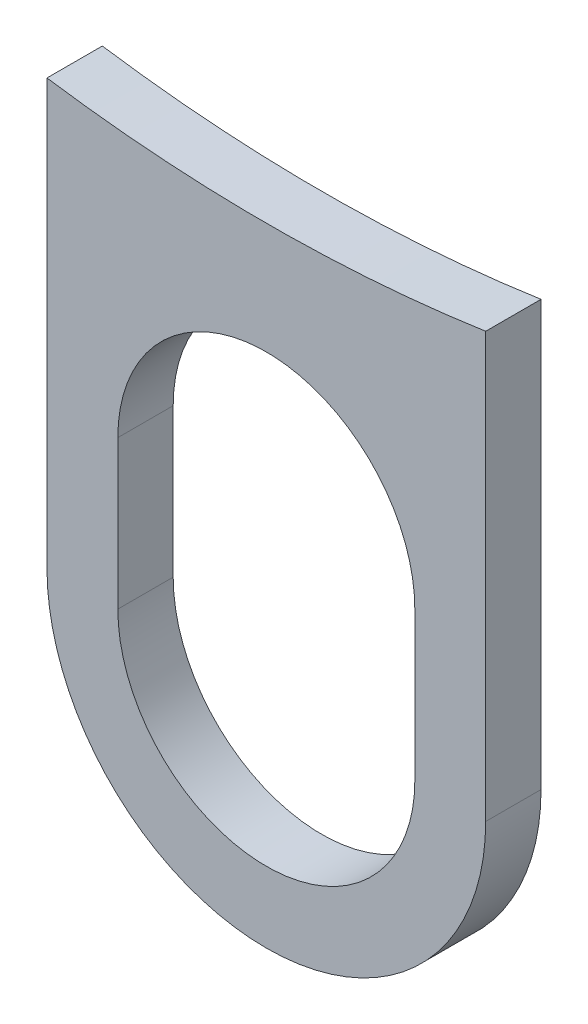
ISO-10303-21;
HEADER;
FILE_DESCRIPTION(('STEP AP214'),'2;1');
FILE_NAME('part.step','',(''),(''),'','','');
FILE_SCHEMA(('AUTOMOTIVE_DESIGN { 1 0 10303 214 1 1 1 1 }'));
ENDSEC;
DATA;
#1=APPLICATION_CONTEXT('core data for automotive mechanical design processes');
#2=APPLICATION_PROTOCOL_DEFINITION('international standard','automotive_design',2000,#1);
#3=PRODUCT_CONTEXT('',#1,'mechanical');
#4=PRODUCT('Part','Part','',(#3));
#5=PRODUCT_RELATED_PRODUCT_CATEGORY('part','',(#4));
#6=PRODUCT_DEFINITION_FORMATION('','',#4);
#7=PRODUCT_DEFINITION_CONTEXT('part definition',#1,'design');
#8=PRODUCT_DEFINITION('design','',#6,#7);
#9=PRODUCT_DEFINITION_SHAPE('','',#8);
#10=(LENGTH_UNIT() NAMED_UNIT(*) SI_UNIT(.MILLI.,.METRE.));
#11=(NAMED_UNIT(*) PLANE_ANGLE_UNIT() SI_UNIT($,.RADIAN.));
#12=(NAMED_UNIT(*) SI_UNIT($,.STERADIAN.) SOLID_ANGLE_UNIT());
#13=UNCERTAINTY_MEASURE_WITH_UNIT(LENGTH_MEASURE(1.E-05),#10,'distance_accuracy_value','');
#14=(GEOMETRIC_REPRESENTATION_CONTEXT(3) GLOBAL_UNCERTAINTY_ASSIGNED_CONTEXT((#13)) GLOBAL_UNIT_ASSIGNED_CONTEXT((#10,
#11,#12)) REPRESENTATION_CONTEXT('',''));
#15=CARTESIAN_POINT('',(0.,0.,0.));
#16=DIRECTION('',(0.,0.,1.));
#17=DIRECTION('',(1.,0.,0.));
#18=AXIS2_PLACEMENT_3D('',#15,#16,#17);
#19=CARTESIAN_POINT('',(1.949022E-13,-1.37733682440434,0.41));
#20=DIRECTION('',(0.,0.,1.));
#21=DIRECTION('',(1.,0.,0.));
#22=AXIS2_PLACEMENT_3D('',#19,#20,#21);
#23=PLANE('',#22);
#24=DIRECTION('',(0.,1.,0.));
#25=VECTOR('',#24,1.);
#26=CARTESIAN_POINT('',(-1.0999999999998,-2.3834906927467,0.41));
#27=LINE('',#26,#25);
#28=CARTESIAN_POINT('',(-1.0999999999998,-2.3834906927467,0.41));
#29=VERTEX_POINT('',#28);
#30=CARTESIAN_POINT('',(-1.0999999999998,-1.2834906927467,0.41));
#31=VERTEX_POINT('',#30);
#32=EDGE_CURVE('E190',#29,#31,#27,.T.);
#33=ORIENTED_EDGE('',*,*,#32,.T.);
#34=CARTESIAN_POINT('',(1.948441E-13,-1.2834906927467,0.41));
#35=DIRECTION('',(0.,0.,-1.));
#36=DIRECTION('',(-1.,0.,0.));
#37=AXIS2_PLACEMENT_3D('',#34,#35,#36);
#38=CIRCLE('',#37,1.1);
#39=CARTESIAN_POINT('',(1.10000000000019,-1.2834906927467,0.41));
#40=VERTEX_POINT('',#39);
#41=EDGE_CURVE('E60',#31,#40,#38,.T.);
#42=ORIENTED_EDGE('',*,*,#41,.T.);
#43=DIRECTION('',(0.,-1.,0.));
#44=VECTOR('',#43,1.);
#45=CARTESIAN_POINT('',(1.10000000000019,-1.2834906927467,0.41));
#46=LINE('',#45,#44);
#47=CARTESIAN_POINT('',(1.10000000000019,-2.3834906927467,0.41));
#48=VERTEX_POINT('',#47);
#49=EDGE_CURVE('E184',#40,#48,#46,.T.);
#50=ORIENTED_EDGE('',*,*,#49,.T.);
#51=CARTESIAN_POINT('',(1.948441E-13,-2.3834906927467,0.41));
#52=DIRECTION('',(0.,0.,-1.));
#53=DIRECTION('',(1.,0.,0.));
#54=AXIS2_PLACEMENT_3D('',#51,#52,#53);
#55=CIRCLE('',#54,1.1);
#56=EDGE_CURVE('E74',#48,#29,#55,.T.);
#57=ORIENTED_EDGE('',*,*,#56,.T.);
#58=EDGE_LOOP('',(#33,#42,#50,#57));
#59=FACE_BOUND('',#58,.T.);
#60=CARTESIAN_POINT('',(1.979666E-13,11.7520268109926,0.41));
#61=DIRECTION('',(0.,0.,1.));
#62=DIRECTION('',(0.146264626462647,0.989245499886526,0.));
#63=AXIS2_PLACEMENT_3D('',#60,#61,#62);
#64=CIRCLE('',#63,11.11);
#65=CARTESIAN_POINT('',(-1.62499999999981,0.7615093072533,0.41));
#66=VERTEX_POINT('',#65);
#67=CARTESIAN_POINT('',(1.62500000000019,0.761509307253299,0.41));
#68=VERTEX_POINT('',#67);
#69=EDGE_CURVE('E119',#66,#68,#64,.T.);
#70=ORIENTED_EDGE('',*,*,#69,.F.);
#71=DIRECTION('',(0.,1.,0.));
#72=VECTOR('',#71,1.);
#73=CARTESIAN_POINT('',(-1.62499999999981,-2.3834906927467,0.41));
#74=LINE('',#73,#72);
#75=CARTESIAN_POINT('',(-1.62499999999981,-2.3834906927467,0.41));
#76=VERTEX_POINT('',#75);
#77=EDGE_CURVE('E26',#76,#66,#74,.T.);
#78=ORIENTED_EDGE('',*,*,#77,.F.);
#79=CARTESIAN_POINT('',(1.941503E-13,-2.3834906927467,0.41));
#80=DIRECTION('',(0.,0.,-1.));
#81=DIRECTION('',(-1.,0.,0.));
#82=AXIS2_PLACEMENT_3D('',#79,#80,#81);
#83=CIRCLE('',#82,1.625);
#84=CARTESIAN_POINT('',(1.62500000000019,-2.3834906927467,0.41));
#85=VERTEX_POINT('',#84);
#86=EDGE_CURVE('E147',#85,#76,#83,.T.);
#87=ORIENTED_EDGE('',*,*,#86,.F.);
#88=DIRECTION('',(0.,-1.,0.));
#89=VECTOR('',#88,1.);
#90=CARTESIAN_POINT('',(1.62500000000019,0.761509307253299,0.41));
#91=LINE('',#90,#89);
#92=EDGE_CURVE('E123',#68,#85,#91,.T.);
#93=ORIENTED_EDGE('',*,*,#92,.F.);
#94=EDGE_LOOP('',(#70,#78,#87,#93));
#95=FACE_BOUND('',#94,.T.);
#96=ADVANCED_FACE('F16',(#59,#95),#23,.T.);
#97=CARTESIAN_POINT('',(1.948788E-13,-1.37733682440434,0.));
#98=DIRECTION('',(0.,0.,1.));
#99=DIRECTION('',(1.,0.,0.));
#100=AXIS2_PLACEMENT_3D('',#97,#98,#99);
#101=PLANE('',#100);
#102=DIRECTION('',(0.,-1.,0.));
#103=VECTOR('',#102,1.);
#104=CARTESIAN_POINT('',(-1.0999999999998,-1.2834906927467,0.));
#105=LINE('',#104,#103);
#106=CARTESIAN_POINT('',(-1.0999999999998,-1.2834906927467,0.));
#107=VERTEX_POINT('',#106);
#108=CARTESIAN_POINT('',(-1.0999999999998,-2.3834906927467,0.));
#109=VERTEX_POINT('',#108);
#110=EDGE_CURVE('E175',#107,#109,#105,.T.);
#111=ORIENTED_EDGE('',*,*,#110,.T.);
#112=CARTESIAN_POINT('',(1.948441E-13,-2.3834906927467,0.));
#113=DIRECTION('',(0.,0.,1.));
#114=DIRECTION('',(1.,0.,0.));
#115=AXIS2_PLACEMENT_3D('',#112,#113,#114);
#116=CIRCLE('',#115,1.1);
#117=CARTESIAN_POINT('',(1.10000000000019,-2.3834906927467,0.));
#118=VERTEX_POINT('',#117);
#119=EDGE_CURVE('E129',#109,#118,#116,.T.);
#120=ORIENTED_EDGE('',*,*,#119,.T.);
#121=DIRECTION('',(0.,1.,0.));
#122=VECTOR('',#121,1.);
#123=CARTESIAN_POINT('',(1.10000000000019,-2.3834906927467,0.));
#124=LINE('',#123,#122);
#125=CARTESIAN_POINT('',(1.10000000000019,-1.2834906927467,0.));
#126=VERTEX_POINT('',#125);
#127=EDGE_CURVE('E145',#118,#126,#124,.T.);
#128=ORIENTED_EDGE('',*,*,#127,.T.);
#129=CARTESIAN_POINT('',(1.948441E-13,-1.2834906927467,0.));
#130=DIRECTION('',(0.,0.,1.));
#131=DIRECTION('',(-1.,0.,0.));
#132=AXIS2_PLACEMENT_3D('',#129,#130,#131);
#133=CIRCLE('',#132,1.1);
#134=EDGE_CURVE('E185',#126,#107,#133,.T.);
#135=ORIENTED_EDGE('',*,*,#134,.T.);
#136=EDGE_LOOP('',(#111,#120,#128,#135));
#137=FACE_BOUND('',#136,.T.);
#138=DIRECTION('',(0.,-1.,0.));
#139=VECTOR('',#138,1.);
#140=CARTESIAN_POINT('',(-1.62499999999981,0.7615093072533,0.));
#141=LINE('',#140,#139);
#142=CARTESIAN_POINT('',(-1.62499999999981,0.7615093072533,0.));
#143=VERTEX_POINT('',#142);
#144=CARTESIAN_POINT('',(-1.62499999999981,-2.3834906927467,0.));
#145=VERTEX_POINT('',#144);
#146=EDGE_CURVE('E11',#143,#145,#141,.T.);
#147=ORIENTED_EDGE('',*,*,#146,.F.);
#148=CARTESIAN_POINT('',(1.979666E-13,11.7520268109926,0.));
#149=DIRECTION('',(0.,0.,-1.));
#150=DIRECTION('',(0.146264626462647,0.989245499886526,0.));
#151=AXIS2_PLACEMENT_3D('',#148,#149,#150);
#152=CIRCLE('',#151,11.11);
#153=CARTESIAN_POINT('',(1.62500000000019,0.761509307253299,0.));
#154=VERTEX_POINT('',#153);
#155=EDGE_CURVE('E121',#154,#143,#152,.T.);
#156=ORIENTED_EDGE('',*,*,#155,.F.);
#157=DIRECTION('',(0.,1.,0.));
#158=VECTOR('',#157,1.);
#159=CARTESIAN_POINT('',(1.62500000000019,-2.3834906927467,0.));
#160=LINE('',#159,#158);
#161=CARTESIAN_POINT('',(1.62500000000019,-2.3834906927467,0.));
#162=VERTEX_POINT('',#161);
#163=EDGE_CURVE('E159',#162,#154,#160,.T.);
#164=ORIENTED_EDGE('',*,*,#163,.F.);
#165=CARTESIAN_POINT('',(1.941503E-13,-2.3834906927467,0.));
#166=DIRECTION('',(0.,0.,1.));
#167=DIRECTION('',(-1.,0.,0.));
#168=AXIS2_PLACEMENT_3D('',#165,#166,#167);
#169=CIRCLE('',#168,1.625);
#170=EDGE_CURVE('E113',#145,#162,#169,.T.);
#171=ORIENTED_EDGE('',*,*,#170,.F.);
#172=EDGE_LOOP('',(#147,#156,#164,#171));
#173=FACE_BOUND('',#172,.T.);
#174=ADVANCED_FACE('F160',(#137,#173),#101,.F.);
#175=CARTESIAN_POINT('',(-1.62499999999981,-2.3834906927467,0.));
#176=DIRECTION('',(-1.,0.,0.));
#177=DIRECTION('',(0.,0.,1.));
#178=AXIS2_PLACEMENT_3D('',#175,#176,#177);
#179=PLANE('',#178);
#180=ORIENTED_EDGE('',*,*,#77,.T.);
#181=DIRECTION('',(0.,0.,1.));
#182=VECTOR('',#181,1.);
#183=CARTESIAN_POINT('',(-1.62499999999981,0.7615093072533,0.));
#184=LINE('',#183,#182);
#185=EDGE_CURVE('E105',#143,#66,#184,.T.);
#186=ORIENTED_EDGE('',*,*,#185,.F.);
#187=ORIENTED_EDGE('',*,*,#146,.T.);
#188=DIRECTION('',(0.,0.,1.));
#189=VECTOR('',#188,1.);
#190=CARTESIAN_POINT('',(-1.62499999999981,-2.3834906927467,0.));
#191=LINE('',#190,#189);
#192=EDGE_CURVE('E108',#145,#76,#191,.T.);
#193=ORIENTED_EDGE('',*,*,#192,.T.);
#194=EDGE_LOOP('',(#180,#186,#187,#193));
#195=FACE_BOUND('',#194,.T.);
#196=ADVANCED_FACE('F104',(#195),#179,.T.);
#197=CARTESIAN_POINT('',(1.941503E-13,-2.3834906927467,0.));
#198=DIRECTION('',(0.,0.,1.));
#199=DIRECTION('',(-1.,0.,0.));
#200=AXIS2_PLACEMENT_3D('',#197,#198,#199);
#201=CYLINDRICAL_SURFACE('',#200,1.625);
#202=ORIENTED_EDGE('',*,*,#86,.T.);
#203=ORIENTED_EDGE('',*,*,#192,.F.);
#204=ORIENTED_EDGE('',*,*,#170,.T.);
#205=DIRECTION('',(0.,0.,1.));
#206=VECTOR('',#205,1.);
#207=CARTESIAN_POINT('',(1.62500000000019,-2.3834906927467,0.));
#208=LINE('',#207,#206);
#209=EDGE_CURVE('E156',#162,#85,#208,.T.);
#210=ORIENTED_EDGE('',*,*,#209,.T.);
#211=EDGE_LOOP('',(#202,#203,#204,#210));
#212=FACE_BOUND('',#211,.T.);
#213=ADVANCED_FACE('F18',(#212),#201,.T.);
#214=CARTESIAN_POINT('',(1.62500000000019,0.761509307253299,0.));
#215=DIRECTION('',(1.,0.,0.));
#216=DIRECTION('',(0.,1.,0.));
#217=AXIS2_PLACEMENT_3D('',#214,#215,#216);
#218=PLANE('',#217);
#219=ORIENTED_EDGE('',*,*,#92,.T.);
#220=ORIENTED_EDGE('',*,*,#209,.F.);
#221=ORIENTED_EDGE('',*,*,#163,.T.);
#222=DIRECTION('',(0.,0.,1.));
#223=VECTOR('',#222,1.);
#224=CARTESIAN_POINT('',(1.62500000000019,0.761509307253299,0.));
#225=LINE('',#224,#223);
#226=EDGE_CURVE('E128',#154,#68,#225,.T.);
#227=ORIENTED_EDGE('',*,*,#226,.T.);
#228=EDGE_LOOP('',(#219,#220,#221,#227));
#229=FACE_BOUND('',#228,.T.);
#230=ADVANCED_FACE('F164',(#229),#218,.T.);
#231=CARTESIAN_POINT('',(1.979666E-13,11.7520268109926,0.));
#232=DIRECTION('',(0.,0.,1.));
#233=DIRECTION('',(0.146264626462647,0.989245499886526,0.));
#234=AXIS2_PLACEMENT_3D('',#231,#232,#233);
#235=CYLINDRICAL_SURFACE('',#234,11.11);
#236=ORIENTED_EDGE('',*,*,#69,.T.);
#237=ORIENTED_EDGE('',*,*,#226,.F.);
#238=ORIENTED_EDGE('',*,*,#155,.T.);
#239=ORIENTED_EDGE('',*,*,#185,.T.);
#240=EDGE_LOOP('',(#236,#237,#238,#239));
#241=FACE_BOUND('',#240,.T.);
#242=ADVANCED_FACE('F117',(#241),#235,.F.);
#243=CARTESIAN_POINT('',(1.948441E-13,-2.3834906927467,0.));
#244=DIRECTION('',(0.,0.,1.));
#245=DIRECTION('',(1.,0.,0.));
#246=AXIS2_PLACEMENT_3D('',#243,#244,#245);
#247=CYLINDRICAL_SURFACE('',#246,1.1);
#248=ORIENTED_EDGE('',*,*,#56,.F.);
#249=DIRECTION('',(0.,0.,1.));
#250=VECTOR('',#249,1.);
#251=CARTESIAN_POINT('',(1.10000000000019,-2.3834906927467,0.));
#252=LINE('',#251,#250);
#253=EDGE_CURVE('E141',#118,#48,#252,.T.);
#254=ORIENTED_EDGE('',*,*,#253,.F.);
#255=ORIENTED_EDGE('',*,*,#119,.F.);
#256=DIRECTION('',(0.,0.,1.));
#257=VECTOR('',#256,1.);
#258=CARTESIAN_POINT('',(-1.0999999999998,-2.3834906927467,0.));
#259=LINE('',#258,#257);
#260=EDGE_CURVE('E179',#109,#29,#259,.T.);
#261=ORIENTED_EDGE('',*,*,#260,.T.);
#262=EDGE_LOOP('',(#248,#254,#255,#261));
#263=FACE_BOUND('',#262,.T.);
#264=ADVANCED_FACE('F208',(#263),#247,.F.);
#265=CARTESIAN_POINT('',(1.10000000000019,-1.2834906927467,0.));
#266=DIRECTION('',(1.,0.,0.));
#267=DIRECTION('',(0.,1.,0.));
#268=AXIS2_PLACEMENT_3D('',#265,#266,#267);
#269=PLANE('',#268);
#270=ORIENTED_EDGE('',*,*,#49,.F.);
#271=DIRECTION('',(0.,0.,1.));
#272=VECTOR('',#271,1.);
#273=CARTESIAN_POINT('',(1.10000000000019,-1.2834906927467,0.));
#274=LINE('',#273,#272);
#275=EDGE_CURVE('E181',#126,#40,#274,.T.);
#276=ORIENTED_EDGE('',*,*,#275,.F.);
#277=ORIENTED_EDGE('',*,*,#127,.F.);
#278=ORIENTED_EDGE('',*,*,#253,.T.);
#279=EDGE_LOOP('',(#270,#276,#277,#278));
#280=FACE_BOUND('',#279,.T.);
#281=ADVANCED_FACE('F212',(#280),#269,.F.);
#282=CARTESIAN_POINT('',(1.948441E-13,-1.2834906927467,0.));
#283=DIRECTION('',(0.,0.,1.));
#284=DIRECTION('',(-1.,0.,0.));
#285=AXIS2_PLACEMENT_3D('',#282,#283,#284);
#286=CYLINDRICAL_SURFACE('',#285,1.1);
#287=ORIENTED_EDGE('',*,*,#41,.F.);
#288=DIRECTION('',(0.,0.,1.));
#289=VECTOR('',#288,1.);
#290=CARTESIAN_POINT('',(-1.0999999999998,-1.2834906927467,0.));
#291=LINE('',#290,#289);
#292=EDGE_CURVE('E178',#107,#31,#291,.T.);
#293=ORIENTED_EDGE('',*,*,#292,.F.);
#294=ORIENTED_EDGE('',*,*,#134,.F.);
#295=ORIENTED_EDGE('',*,*,#275,.T.);
#296=EDGE_LOOP('',(#287,#293,#294,#295));
#297=FACE_BOUND('',#296,.T.);
#298=ADVANCED_FACE('F201',(#297),#286,.F.);
#299=CARTESIAN_POINT('',(-1.0999999999998,-2.3834906927467,0.));
#300=DIRECTION('',(-1.,0.,0.));
#301=DIRECTION('',(0.,0.,1.));
#302=AXIS2_PLACEMENT_3D('',#299,#300,#301);
#303=PLANE('',#302);
#304=ORIENTED_EDGE('',*,*,#32,.F.);
#305=ORIENTED_EDGE('',*,*,#260,.F.);
#306=ORIENTED_EDGE('',*,*,#110,.F.);
#307=ORIENTED_EDGE('',*,*,#292,.T.);
#308=EDGE_LOOP('',(#304,#305,#306,#307));
#309=FACE_BOUND('',#308,.T.);
#310=ADVANCED_FACE('F206',(#309),#303,.F.);
#311=CLOSED_SHELL('',(#96,#174,#196,#213,#230,#242,#264,#281,#298,#310));
#312=MANIFOLD_SOLID_BREP('B1',#311);
#313=ADVANCED_BREP_SHAPE_REPRESENTATION('',(#18,#312),#14);
#314=SHAPE_DEFINITION_REPRESENTATION(#9,#313);
ENDSEC;
END-ISO-10303-21;
